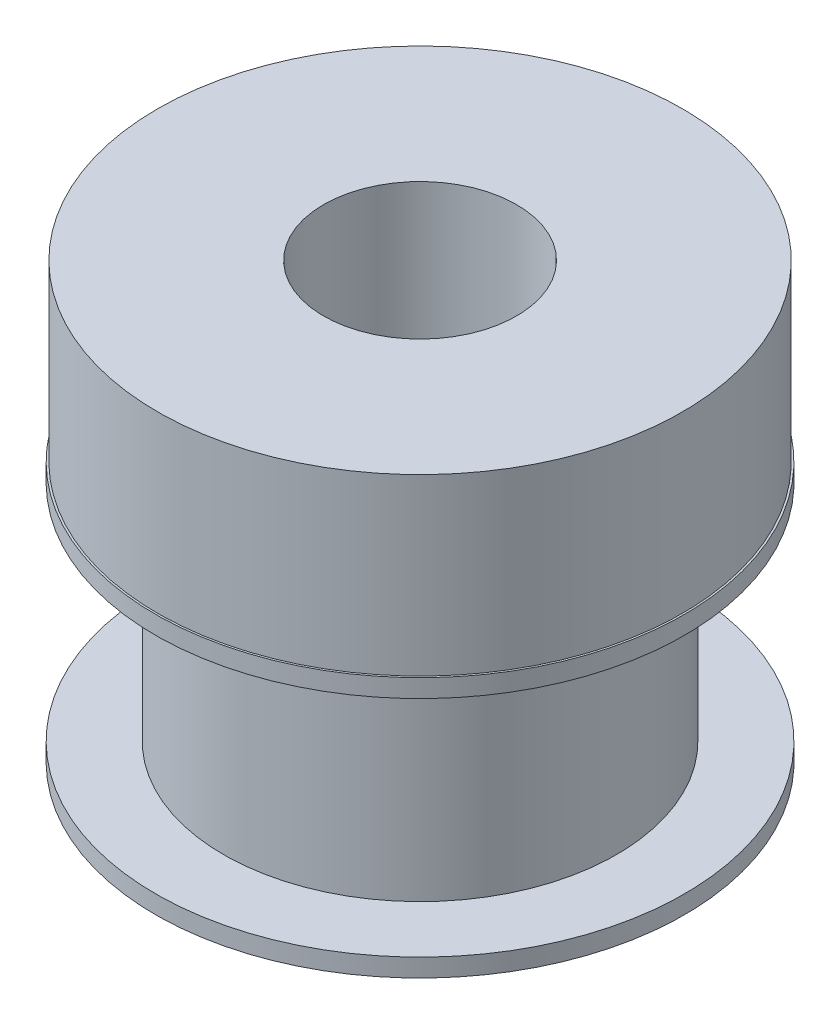
ISO-10303-21;
HEADER;
FILE_DESCRIPTION(('STEP AP214'),'2;1');
FILE_NAME('part.step','',(''),(''),'','','');
FILE_SCHEMA(('AUTOMOTIVE_DESIGN { 1 0 10303 214 1 1 1 1 }'));
ENDSEC;
DATA;
#1=APPLICATION_CONTEXT('core data for automotive mechanical design processes');
#2=APPLICATION_PROTOCOL_DEFINITION('international standard','automotive_design',2000,#1);
#3=PRODUCT_CONTEXT('',#1,'mechanical');
#4=PRODUCT('Part','Part','',(#3));
#5=PRODUCT_RELATED_PRODUCT_CATEGORY('part','',(#4));
#6=PRODUCT_DEFINITION_FORMATION('','',#4);
#7=PRODUCT_DEFINITION_CONTEXT('part definition',#1,'design');
#8=PRODUCT_DEFINITION('design','',#6,#7);
#9=PRODUCT_DEFINITION_SHAPE('','',#8);
#10=(LENGTH_UNIT() NAMED_UNIT(*) SI_UNIT(.MILLI.,.METRE.));
#11=(NAMED_UNIT(*) PLANE_ANGLE_UNIT() SI_UNIT($,.RADIAN.));
#12=(NAMED_UNIT(*) SI_UNIT($,.STERADIAN.) SOLID_ANGLE_UNIT());
#13=UNCERTAINTY_MEASURE_WITH_UNIT(LENGTH_MEASURE(1.E-05),#10,'distance_accuracy_value','');
#14=(GEOMETRIC_REPRESENTATION_CONTEXT(3) GLOBAL_UNCERTAINTY_ASSIGNED_CONTEXT((#13)) GLOBAL_UNIT_ASSIGNED_CONTEXT((#10,
#11,#12)) REPRESENTATION_CONTEXT('',''));
#15=CARTESIAN_POINT('',(0.,0.,0.));
#16=DIRECTION('',(0.,0.,1.));
#17=DIRECTION('',(1.,0.,0.));
#18=AXIS2_PLACEMENT_3D('',#15,#16,#17);
#19=CARTESIAN_POINT('',(8.69950000000001,0.596900000000001,0.));
#20=DIRECTION('',(0.,-1.,0.));
#21=DIRECTION('',(1.,0.,0.));
#22=AXIS2_PLACEMENT_3D('',#19,#20,#21);
#23=PLANE('',#22);
#24=CARTESIAN_POINT('',(0.,0.596900000000001,0.));
#25=DIRECTION('',(0.,1.,0.));
#26=DIRECTION('',(-1.,0.,0.));
#27=AXIS2_PLACEMENT_3D('',#24,#25,#26);
#28=CIRCLE('',#27,6.4643);
#29=CARTESIAN_POINT('',(-6.4643,0.5969,0.));
#30=VERTEX_POINT('',#29);
#31=EDGE_CURVE('E65',#30,#30,#28,.T.);
#32=ORIENTED_EDGE('',*,*,#31,.F.);
#33=EDGE_LOOP('',(#32));
#34=FACE_BOUND('',#33,.T.);
#35=CARTESIAN_POINT('',(0.,0.596900000000001,0.));
#36=DIRECTION('',(0.,1.,0.));
#37=DIRECTION('',(-1.,0.,0.));
#38=AXIS2_PLACEMENT_3D('',#35,#36,#37);
#39=CIRCLE('',#38,8.6995);
#40=CARTESIAN_POINT('',(-8.6995,0.5969,0.));
#41=VERTEX_POINT('',#40);
#42=EDGE_CURVE('E10',#41,#41,#39,.T.);
#43=ORIENTED_EDGE('',*,*,#42,.T.);
#44=EDGE_LOOP('',(#43));
#45=FACE_BOUND('',#44,.T.);
#46=ADVANCED_FACE('F31',(#34,#45),#23,.F.);
#47=CARTESIAN_POINT('',(0.,26.6826021768739,0.));
#48=DIRECTION('',(0.,1.,0.));
#49=DIRECTION('',(-1.,0.,0.));
#50=AXIS2_PLACEMENT_3D('',#47,#48,#49);
#51=CYLINDRICAL_SURFACE('',#50,8.6995);
#52=ORIENTED_EDGE('',*,*,#42,.F.);
#53=EDGE_LOOP('',(#52));
#54=FACE_BOUND('',#53,.T.);
#55=CARTESIAN_POINT('',(0.,0.,0.));
#56=DIRECTION('',(0.,1.,0.));
#57=DIRECTION('',(-1.,0.,0.));
#58=AXIS2_PLACEMENT_3D('',#55,#56,#57);
#59=CIRCLE('',#58,8.6995);
#60=CARTESIAN_POINT('',(-8.6995,0.,0.));
#61=VERTEX_POINT('',#60);
#62=EDGE_CURVE('E37',#61,#61,#59,.T.);
#63=ORIENTED_EDGE('',*,*,#62,.T.);
#64=EDGE_LOOP('',(#63));
#65=FACE_BOUND('',#64,.T.);
#66=ADVANCED_FACE('F72',(#54,#65),#51,.T.);
#67=CARTESIAN_POINT('',(3.175,0.,0.));
#68=DIRECTION('',(0.,1.,0.));
#69=DIRECTION('',(-1.,0.,0.));
#70=AXIS2_PLACEMENT_3D('',#67,#68,#69);
#71=PLANE('',#70);
#72=ORIENTED_EDGE('',*,*,#62,.F.);
#73=EDGE_LOOP('',(#72));
#74=FACE_BOUND('',#73,.T.);
#75=CARTESIAN_POINT('',(0.,0.,0.));
#76=DIRECTION('',(0.,1.,0.));
#77=DIRECTION('',(-1.,0.,0.));
#78=AXIS2_PLACEMENT_3D('',#75,#76,#77);
#79=CIRCLE('',#78,3.175);
#80=CARTESIAN_POINT('',(-3.175,0.,0.));
#81=VERTEX_POINT('',#80);
#82=EDGE_CURVE('E41',#81,#81,#79,.T.);
#83=ORIENTED_EDGE('',*,*,#82,.T.);
#84=EDGE_LOOP('',(#83));
#85=FACE_BOUND('',#84,.T.);
#86=ADVANCED_FACE('F76',(#74,#85),#71,.F.);
#87=CARTESIAN_POINT('',(0.,26.6826021768739,0.));
#88=DIRECTION('',(0.,1.,0.));
#89=DIRECTION('',(-1.,0.,0.));
#90=AXIS2_PLACEMENT_3D('',#87,#88,#89);
#91=CYLINDRICAL_SURFACE('',#90,3.175);
#92=ORIENTED_EDGE('',*,*,#82,.F.);
#93=EDGE_LOOP('',(#92));
#94=FACE_BOUND('',#93,.T.);
#95=CARTESIAN_POINT('',(0.,14.3002,0.));
#96=DIRECTION('',(0.,1.,0.));
#97=DIRECTION('',(-1.,0.,0.));
#98=AXIS2_PLACEMENT_3D('',#95,#96,#97);
#99=CIRCLE('',#98,3.175);
#100=CARTESIAN_POINT('',(-3.175,14.3002,0.));
#101=VERTEX_POINT('',#100);
#102=EDGE_CURVE('E45',#101,#101,#99,.T.);
#103=ORIENTED_EDGE('',*,*,#102,.T.);
#104=EDGE_LOOP('',(#103));
#105=FACE_BOUND('',#104,.T.);
#106=ADVANCED_FACE('F81',(#94,#105),#91,.F.);
#107=CARTESIAN_POINT('',(8.636,14.3002,0.));
#108=DIRECTION('',(0.,-1.,0.));
#109=DIRECTION('',(1.,0.,0.));
#110=AXIS2_PLACEMENT_3D('',#107,#108,#109);
#111=PLANE('',#110);
#112=ORIENTED_EDGE('',*,*,#102,.F.);
#113=EDGE_LOOP('',(#112));
#114=FACE_BOUND('',#113,.T.);
#115=CARTESIAN_POINT('',(0.,14.3002,0.));
#116=DIRECTION('',(0.,1.,0.));
#117=DIRECTION('',(-1.,0.,0.));
#118=AXIS2_PLACEMENT_3D('',#115,#116,#117);
#119=CIRCLE('',#118,8.636);
#120=CARTESIAN_POINT('',(-8.636,14.3002,0.));
#121=VERTEX_POINT('',#120);
#122=EDGE_CURVE('E50',#121,#121,#119,.T.);
#123=ORIENTED_EDGE('',*,*,#122,.T.);
#124=EDGE_LOOP('',(#123));
#125=FACE_BOUND('',#124,.T.);
#126=ADVANCED_FACE('F87',(#114,#125),#111,.F.);
#127=CARTESIAN_POINT('',(0.,26.6826021768739,0.));
#128=DIRECTION('',(0.,1.,0.));
#129=DIRECTION('',(-1.,0.,0.));
#130=AXIS2_PLACEMENT_3D('',#127,#128,#129);
#131=CYLINDRICAL_SURFACE('',#130,8.636);
#132=ORIENTED_EDGE('',*,*,#122,.F.);
#133=EDGE_LOOP('',(#132));
#134=FACE_BOUND('',#133,.T.);
#135=CARTESIAN_POINT('',(0.,8.5598,0.));
#136=DIRECTION('',(0.,1.,0.));
#137=DIRECTION('',(-1.,0.,0.));
#138=AXIS2_PLACEMENT_3D('',#135,#136,#137);
#139=CIRCLE('',#138,8.636);
#140=CARTESIAN_POINT('',(-8.636,8.5598,0.));
#141=VERTEX_POINT('',#140);
#142=EDGE_CURVE('E53',#141,#141,#139,.T.);
#143=ORIENTED_EDGE('',*,*,#142,.T.);
#144=EDGE_LOOP('',(#143));
#145=FACE_BOUND('',#144,.T.);
#146=ADVANCED_FACE('F91',(#134,#145),#131,.T.);
#147=CARTESIAN_POINT('',(8.69950000000001,8.5598,0.));
#148=DIRECTION('',(0.,-1.,0.));
#149=DIRECTION('',(1.,0.,0.));
#150=AXIS2_PLACEMENT_3D('',#147,#148,#149);
#151=PLANE('',#150);
#152=ORIENTED_EDGE('',*,*,#142,.F.);
#153=EDGE_LOOP('',(#152));
#154=FACE_BOUND('',#153,.T.);
#155=CARTESIAN_POINT('',(0.,8.5598,0.));
#156=DIRECTION('',(0.,1.,0.));
#157=DIRECTION('',(-1.,0.,0.));
#158=AXIS2_PLACEMENT_3D('',#155,#156,#157);
#159=CIRCLE('',#158,8.6995);
#160=CARTESIAN_POINT('',(-8.6995,8.5598,0.));
#161=VERTEX_POINT('',#160);
#162=EDGE_CURVE('E56',#161,#161,#159,.T.);
#163=ORIENTED_EDGE('',*,*,#162,.T.);
#164=EDGE_LOOP('',(#163));
#165=FACE_BOUND('',#164,.T.);
#166=ADVANCED_FACE('F95',(#154,#165),#151,.F.);
#167=CARTESIAN_POINT('',(0.,26.6826021768739,0.));
#168=DIRECTION('',(0.,1.,0.));
#169=DIRECTION('',(-1.,0.,0.));
#170=AXIS2_PLACEMENT_3D('',#167,#168,#169);
#171=CYLINDRICAL_SURFACE('',#170,8.69950000000001);
#172=ORIENTED_EDGE('',*,*,#162,.F.);
#173=EDGE_LOOP('',(#172));
#174=FACE_BOUND('',#173,.T.);
#175=CARTESIAN_POINT('',(0.,7.9629,0.));
#176=DIRECTION('',(0.,1.,0.));
#177=DIRECTION('',(-1.,0.,0.));
#178=AXIS2_PLACEMENT_3D('',#175,#176,#177);
#179=CIRCLE('',#178,8.69950000000001);
#180=CARTESIAN_POINT('',(-8.6995,7.9629,0.));
#181=VERTEX_POINT('',#180);
#182=EDGE_CURVE('E59',#181,#181,#179,.T.);
#183=ORIENTED_EDGE('',*,*,#182,.T.);
#184=EDGE_LOOP('',(#183));
#185=FACE_BOUND('',#184,.T.);
#186=ADVANCED_FACE('F99',(#174,#185),#171,.T.);
#187=CARTESIAN_POINT('',(6.46430000000001,7.9629,0.));
#188=DIRECTION('',(0.,1.,0.));
#189=DIRECTION('',(-1.,0.,0.));
#190=AXIS2_PLACEMENT_3D('',#187,#188,#189);
#191=PLANE('',#190);
#192=ORIENTED_EDGE('',*,*,#182,.F.);
#193=EDGE_LOOP('',(#192));
#194=FACE_BOUND('',#193,.T.);
#195=CARTESIAN_POINT('',(0.,7.9629,0.));
#196=DIRECTION('',(0.,1.,0.));
#197=DIRECTION('',(-1.,0.,0.));
#198=AXIS2_PLACEMENT_3D('',#195,#196,#197);
#199=CIRCLE('',#198,6.4643);
#200=CARTESIAN_POINT('',(-6.4643,7.9629,0.));
#201=VERTEX_POINT('',#200);
#202=EDGE_CURVE('E62',#201,#201,#199,.T.);
#203=ORIENTED_EDGE('',*,*,#202,.T.);
#204=EDGE_LOOP('',(#203));
#205=FACE_BOUND('',#204,.T.);
#206=ADVANCED_FACE('F103',(#194,#205),#191,.F.);
#207=CARTESIAN_POINT('',(0.,26.6826021768739,0.));
#208=DIRECTION('',(0.,1.,0.));
#209=DIRECTION('',(-1.,0.,0.));
#210=AXIS2_PLACEMENT_3D('',#207,#208,#209);
#211=CYLINDRICAL_SURFACE('',#210,6.4643);
#212=ORIENTED_EDGE('',*,*,#202,.F.);
#213=EDGE_LOOP('',(#212));
#214=FACE_BOUND('',#213,.T.);
#215=ORIENTED_EDGE('',*,*,#31,.T.);
#216=EDGE_LOOP('',(#215));
#217=FACE_BOUND('',#216,.T.);
#218=ADVANCED_FACE('F69',(#214,#217),#211,.T.);
#219=CLOSED_SHELL('',(#46,#66,#86,#106,#126,#146,#166,#186,#206,#218));
#220=MANIFOLD_SOLID_BREP('B2',#219);
#221=ADVANCED_BREP_SHAPE_REPRESENTATION('',(#18,#220),#14);
#222=SHAPE_DEFINITION_REPRESENTATION(#9,#221);
ENDSEC;
END-ISO-10303-21;
